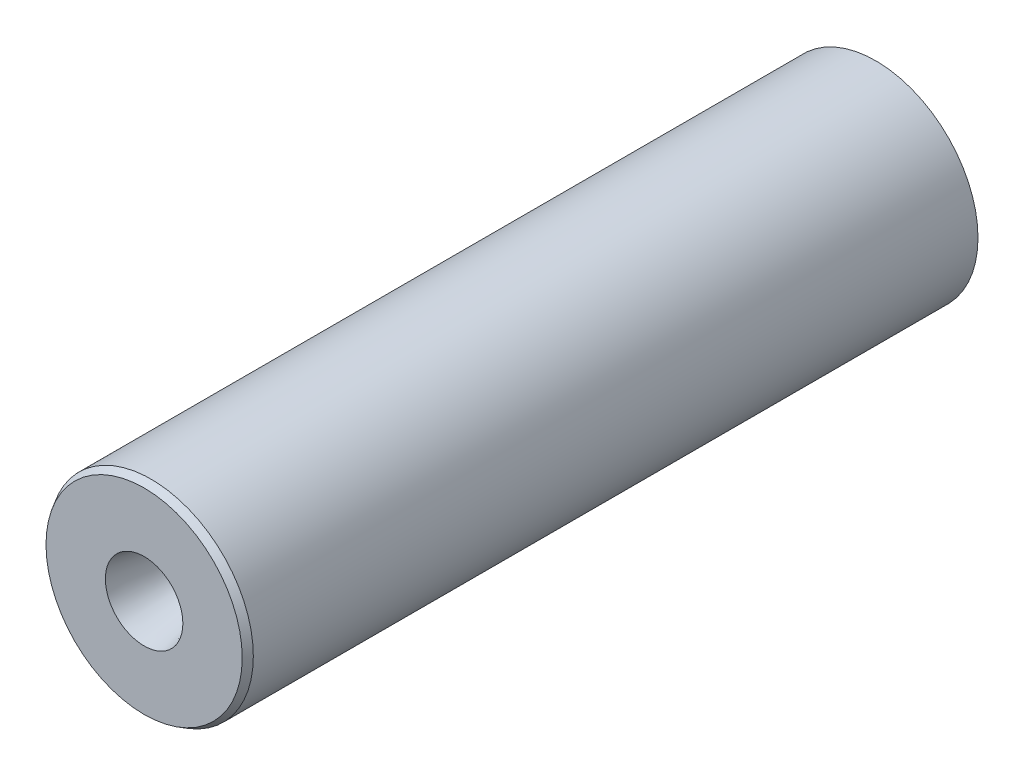
ISO-10303-21;
HEADER;
FILE_DESCRIPTION(('STEP AP214'),'2;1');
FILE_NAME('part.step','',(''),(''),'','','');
FILE_SCHEMA(('AUTOMOTIVE_DESIGN { 1 0 10303 214 1 1 1 1 }'));
ENDSEC;
DATA;
#1=APPLICATION_CONTEXT('core data for automotive mechanical design processes');
#2=APPLICATION_PROTOCOL_DEFINITION('international standard','automotive_design',2000,#1);
#3=PRODUCT_CONTEXT('',#1,'mechanical');
#4=PRODUCT('Part','Part','',(#3));
#5=PRODUCT_RELATED_PRODUCT_CATEGORY('part','',(#4));
#6=PRODUCT_DEFINITION_FORMATION('','',#4);
#7=PRODUCT_DEFINITION_CONTEXT('part definition',#1,'design');
#8=PRODUCT_DEFINITION('design','',#6,#7);
#9=PRODUCT_DEFINITION_SHAPE('','',#8);
#10=(LENGTH_UNIT() NAMED_UNIT(*) SI_UNIT(.MILLI.,.METRE.));
#11=(NAMED_UNIT(*) PLANE_ANGLE_UNIT() SI_UNIT($,.RADIAN.));
#12=(NAMED_UNIT(*) SI_UNIT($,.STERADIAN.) SOLID_ANGLE_UNIT());
#13=UNCERTAINTY_MEASURE_WITH_UNIT(LENGTH_MEASURE(1.E-05),#10,'distance_accuracy_value','');
#14=(GEOMETRIC_REPRESENTATION_CONTEXT(3) GLOBAL_UNCERTAINTY_ASSIGNED_CONTEXT((#13)) GLOBAL_UNIT_ASSIGNED_CONTEXT((#10,
#11,#12)) REPRESENTATION_CONTEXT('',''));
#15=CARTESIAN_POINT('',(0.,0.,0.));
#16=DIRECTION('',(0.,0.,1.));
#17=DIRECTION('',(1.,0.,0.));
#18=AXIS2_PLACEMENT_3D('',#15,#16,#17);
#19=CARTESIAN_POINT('',(0.,0.,51.9181610963858));
#20=DIRECTION('',(0.,0.,1.));
#21=DIRECTION('',(1.,0.,0.));
#22=AXIS2_PLACEMENT_3D('',#19,#20,#21);
#23=CYLINDRICAL_SURFACE('',#22,11.);
#24=CARTESIAN_POINT('',(0.,0.,21.7420929414587));
#25=DIRECTION('',(0.,0.,1.));
#26=DIRECTION('',(1.,0.,0.));
#27=AXIS2_PLACEMENT_3D('',#24,#25,#26);
#28=CIRCLE('',#27,11.);
#29=CARTESIAN_POINT('',(11.,0.,21.7420929414587));
#30=VERTEX_POINT('',#29);
#31=EDGE_CURVE('E56',#30,#30,#28,.T.);
#32=ORIENTED_EDGE('',*,*,#31,.T.);
#33=EDGE_LOOP('',(#32));
#34=FACE_BOUND('',#33,.T.);
#35=CARTESIAN_POINT('',(0.,0.,-36.9181610963857));
#36=DIRECTION('',(0.,0.,-1.));
#37=DIRECTION('',(0.,1.,0.));
#38=AXIS2_PLACEMENT_3D('',#35,#36,#37);
#39=CIRCLE('',#38,11.);
#40=CARTESIAN_POINT('',(0.,11.,-36.9181610963857));
#41=VERTEX_POINT('',#40);
#42=EDGE_CURVE('E60',#41,#41,#39,.F.);
#43=ORIENTED_EDGE('',*,*,#42,.F.);
#44=EDGE_LOOP('',(#43));
#45=FACE_BOUND('',#44,.T.);
#46=ADVANCED_FACE('F33',(#34,#45),#23,.F.);
#47=CARTESIAN_POINT('',(0.,0.,-51.9181610963858));
#48=DIRECTION('',(0.,0.,-1.));
#49=DIRECTION('',(-1.,0.,0.));
#50=AXIS2_PLACEMENT_3D('',#47,#48,#49);
#51=CIRCLE('',#50,11.);
#52=CARTESIAN_POINT('',(-11.,0.,-51.9181610963858));
#53=VERTEX_POINT('',#52);
#54=EDGE_CURVE('E63',#53,#53,#51,.T.);
#55=ORIENTED_EDGE('',*,*,#54,.T.);
#56=EDGE_LOOP('',(#55));
#57=FACE_BOUND('',#56,.T.);
#58=CARTESIAN_POINT('',(0.,0.,-48.9181610963857));
#59=DIRECTION('',(0.,0.,1.));
#60=DIRECTION('',(0.,-1.,0.));
#61=AXIS2_PLACEMENT_3D('',#58,#59,#60);
#62=CIRCLE('',#61,11.);
#63=CARTESIAN_POINT('',(0.,-11.,-48.9181610963857));
#64=VERTEX_POINT('',#63);
#65=EDGE_CURVE('E101',#64,#64,#62,.T.);
#66=ORIENTED_EDGE('',*,*,#65,.T.);
#67=EDGE_LOOP('',(#66));
#68=FACE_BOUND('',#67,.T.);
#69=ADVANCED_FACE('F105',(#57,#68),#23,.F.);
#70=CARTESIAN_POINT('',(0.,14.5,51.9181610963858));
#71=DIRECTION('',(0.,0.,-1.));
#72=DIRECTION('',(-1.,0.,0.));
#73=AXIS2_PLACEMENT_3D('',#70,#71,#72);
#74=PLANE('',#73);
#75=CARTESIAN_POINT('',(0.,0.,51.9181610963858));
#76=DIRECTION('',(0.,0.,-1.));
#77=DIRECTION('',(-1.,0.,0.));
#78=AXIS2_PLACEMENT_3D('',#75,#76,#77);
#79=CIRCLE('',#78,13.9226497308104);
#80=CARTESIAN_POINT('',(-13.9226497308104,0.,51.9181610963858));
#81=VERTEX_POINT('',#80);
#82=EDGE_CURVE('E40',#81,#81,#79,.F.);
#83=ORIENTED_EDGE('',*,*,#82,.T.);
#84=EDGE_LOOP('',(#83));
#85=FACE_BOUND('',#84,.T.);
#86=CARTESIAN_POINT('',(0.,0.,51.9181610963858));
#87=DIRECTION('',(0.,0.,1.));
#88=DIRECTION('',(1.,0.,0.));
#89=AXIS2_PLACEMENT_3D('',#86,#87,#88);
#90=CIRCLE('',#89,5.5);
#91=CARTESIAN_POINT('',(5.5,0.,51.9181610963858));
#92=VERTEX_POINT('',#91);
#93=EDGE_CURVE('E59',#92,#92,#90,.T.);
#94=ORIENTED_EDGE('',*,*,#93,.F.);
#95=EDGE_LOOP('',(#94));
#96=FACE_BOUND('',#95,.T.);
#97=ADVANCED_FACE('F129',(#85,#96),#74,.F.);
#98=CARTESIAN_POINT('',(0.,0.,51.9181610963858));
#99=DIRECTION('',(0.,0.,1.));
#100=DIRECTION('',(1.,0.,0.));
#101=AXIS2_PLACEMENT_3D('',#98,#99,#100);
#102=CONICAL_SURFACE('',#101,5.5,0.209439510239313);
#103=CARTESIAN_POINT('',(0.,0.,39.6816491923393));
#104=DIRECTION('',(0.,0.,-1.));
#105=DIRECTION('',(-1.,0.,0.));
#106=AXIS2_PLACEMENT_3D('',#103,#104,#105);
#107=CIRCLE('',#106,2.89904910284168);
#108=CARTESIAN_POINT('',(-2.89904910284168,0.,39.6816491923393));
#109=VERTEX_POINT('',#108);
#110=EDGE_CURVE('E44',#109,#109,#107,.T.);
#111=ORIENTED_EDGE('',*,*,#110,.T.);
#112=EDGE_LOOP('',(#111));
#113=FACE_BOUND('',#112,.T.);
#114=ORIENTED_EDGE('',*,*,#93,.T.);
#115=EDGE_LOOP('',(#114));
#116=FACE_BOUND('',#115,.T.);
#117=ADVANCED_FACE('F178',(#113,#116),#102,.F.);
#118=CARTESIAN_POINT('',(0.,0.,37.8042707679499));
#119=DIRECTION('',(0.,0.,-1.));
#120=DIRECTION('',(-1.,0.,0.));
#121=AXIS2_PLACEMENT_3D('',#118,#119,#120);
#122=CONICAL_SURFACE('',#121,2.5,0.523598775598293);
#123=CARTESIAN_POINT('',(0.,0.,24.2420929414586));
#124=DIRECTION('',(0.,0.,-1.));
#125=DIRECTION('',(-1.,0.,0.));
#126=AXIS2_PLACEMENT_3D('',#123,#124,#125);
#127=CIRCLE('',#126,10.3301270189222);
#128=CARTESIAN_POINT('',(-10.3301270189222,0.,24.2420929414586));
#129=VERTEX_POINT('',#128);
#130=EDGE_CURVE('E48',#129,#129,#127,.T.);
#131=ORIENTED_EDGE('',*,*,#130,.T.);
#132=EDGE_LOOP('',(#131));
#133=FACE_BOUND('',#132,.T.);
#134=CARTESIAN_POINT('',(0.,0.,36.1420907382506));
#135=DIRECTION('',(0.,0.,1.));
#136=DIRECTION('',(1.,0.,0.));
#137=AXIS2_PLACEMENT_3D('',#134,#135,#136);
#138=CIRCLE('',#137,3.45966008758851);
#139=CARTESIAN_POINT('',(3.45966008758851,0.,36.1420907382506));
#140=VERTEX_POINT('',#139);
#141=EDGE_CURVE('E53',#140,#140,#138,.T.);
#142=ORIENTED_EDGE('',*,*,#141,.T.);
#143=EDGE_LOOP('',(#142));
#144=FACE_BOUND('',#143,.T.);
#145=ADVANCED_FACE('F173',(#133,#144),#122,.F.);
#146=CARTESIAN_POINT('',(0.,14.5,-51.9181610963858));
#147=DIRECTION('',(0.,0.,1.));
#148=DIRECTION('',(1.,0.,0.));
#149=AXIS2_PLACEMENT_3D('',#146,#147,#148);
#150=PLANE('',#149);
#151=ORIENTED_EDGE('',*,*,#54,.F.);
#152=EDGE_LOOP('',(#151));
#153=FACE_BOUND('',#152,.T.);
#154=CARTESIAN_POINT('',(0.,0.,-51.9181610963858));
#155=DIRECTION('',(0.,0.,1.));
#156=DIRECTION('',(1.,0.,0.));
#157=AXIS2_PLACEMENT_3D('',#154,#155,#156);
#158=CIRCLE('',#157,14.5);
#159=CARTESIAN_POINT('',(14.5,0.,-51.9181610963858));
#160=VERTEX_POINT('',#159);
#161=EDGE_CURVE('E67',#160,#160,#158,.T.);
#162=ORIENTED_EDGE('',*,*,#161,.F.);
#163=EDGE_LOOP('',(#162));
#164=FACE_BOUND('',#163,.T.);
#165=ADVANCED_FACE('F171',(#153,#164),#150,.F.);
#166=CARTESIAN_POINT('',(0.,0.,51.9181610963858));
#167=DIRECTION('',(0.,0.,1.));
#168=DIRECTION('',(1.,0.,0.));
#169=AXIS2_PLACEMENT_3D('',#166,#167,#168);
#170=CYLINDRICAL_SURFACE('',#169,14.5);
#171=CARTESIAN_POINT('',(0.,0.,50.9181610963858));
#172=DIRECTION('',(0.,0.,-1.));
#173=DIRECTION('',(-1.,0.,0.));
#174=AXIS2_PLACEMENT_3D('',#171,#172,#173);
#175=CIRCLE('',#174,14.5);
#176=CARTESIAN_POINT('',(-14.5,0.,50.9181610963858));
#177=VERTEX_POINT('',#176);
#178=EDGE_CURVE('E10',#177,#177,#175,.T.);
#179=ORIENTED_EDGE('',*,*,#178,.T.);
#180=EDGE_LOOP('',(#179));
#181=FACE_BOUND('',#180,.T.);
#182=ORIENTED_EDGE('',*,*,#161,.T.);
#183=EDGE_LOOP('',(#182));
#184=FACE_BOUND('',#183,.T.);
#185=ADVANCED_FACE('F169',(#181,#184),#170,.T.);
#186=CARTESIAN_POINT('',(0.,12.,-46.9181610963857));
#187=DIRECTION('',(0.,0.,-1.));
#188=DIRECTION('',(0.,1.,0.));
#189=AXIS2_PLACEMENT_3D('',#186,#187,#188);
#190=PLANE('',#189);
#191=CARTESIAN_POINT('',(0.,0.,-46.9181610963858));
#192=DIRECTION('',(0.,0.,1.));
#193=DIRECTION('',(0.,-1.,0.));
#194=AXIS2_PLACEMENT_3D('',#191,#192,#193);
#195=CIRCLE('',#194,11.);
#196=CARTESIAN_POINT('',(0.,-11.,-46.9181610963858));
#197=VERTEX_POINT('',#196);
#198=EDGE_CURVE('E92',#197,#197,#195,.T.);
#199=ORIENTED_EDGE('',*,*,#198,.T.);
#200=EDGE_LOOP('',(#199));
#201=FACE_BOUND('',#200,.T.);
#202=CARTESIAN_POINT('',(0.,0.,-46.9181610963857));
#203=DIRECTION('',(0.,0.,1.));
#204=DIRECTION('',(0.,-1.,0.));
#205=AXIS2_PLACEMENT_3D('',#202,#203,#204);
#206=CIRCLE('',#205,12.);
#207=CARTESIAN_POINT('',(0.,-12.,-46.9181610963857));
#208=VERTEX_POINT('',#207);
#209=EDGE_CURVE('E95',#208,#208,#206,.T.);
#210=ORIENTED_EDGE('',*,*,#209,.F.);
#211=EDGE_LOOP('',(#210));
#212=FACE_BOUND('',#211,.T.);
#213=ADVANCED_FACE('F121',(#201,#212),#190,.T.);
#214=CARTESIAN_POINT('',(0.,0.,0.));
#215=DIRECTION('',(0.,0.,1.));
#216=DIRECTION('',(0.,-1.,0.));
#217=AXIS2_PLACEMENT_3D('',#214,#215,#216);
#218=CYLINDRICAL_SURFACE('',#217,12.);
#219=ORIENTED_EDGE('',*,*,#209,.T.);
#220=EDGE_LOOP('',(#219));
#221=FACE_BOUND('',#220,.T.);
#222=CARTESIAN_POINT('',(0.,0.,-48.9181610963857));
#223=DIRECTION('',(0.,0.,1.));
#224=DIRECTION('',(0.,-1.,0.));
#225=AXIS2_PLACEMENT_3D('',#222,#223,#224);
#226=CIRCLE('',#225,12.);
#227=CARTESIAN_POINT('',(0.,-12.,-48.9181610963857));
#228=VERTEX_POINT('',#227);
#229=EDGE_CURVE('E98',#228,#228,#226,.T.);
#230=ORIENTED_EDGE('',*,*,#229,.F.);
#231=EDGE_LOOP('',(#230));
#232=FACE_BOUND('',#231,.T.);
#233=ADVANCED_FACE('F110',(#221,#232),#218,.F.);
#234=CARTESIAN_POINT('',(0.,11.,-48.9181610963857));
#235=DIRECTION('',(0.,0.,1.));
#236=DIRECTION('',(0.,-1.,0.));
#237=AXIS2_PLACEMENT_3D('',#234,#235,#236);
#238=PLANE('',#237);
#239=ORIENTED_EDGE('',*,*,#229,.T.);
#240=EDGE_LOOP('',(#239));
#241=FACE_BOUND('',#240,.T.);
#242=ORIENTED_EDGE('',*,*,#65,.F.);
#243=EDGE_LOOP('',(#242));
#244=FACE_BOUND('',#243,.T.);
#245=ADVANCED_FACE('F107',(#241,#244),#238,.T.);
#246=ORIENTED_EDGE('',*,*,#198,.F.);
#247=EDGE_LOOP('',(#246));
#248=FACE_BOUND('',#247,.T.);
#249=CARTESIAN_POINT('',(0.,0.,-43.9181610963858));
#250=DIRECTION('',(0.,0.,1.));
#251=DIRECTION('',(0.,-1.,0.));
#252=AXIS2_PLACEMENT_3D('',#249,#250,#251);
#253=CIRCLE('',#252,11.);
#254=CARTESIAN_POINT('',(0.,-11.,-43.9181610963858));
#255=VERTEX_POINT('',#254);
#256=EDGE_CURVE('E89',#255,#255,#253,.T.);
#257=ORIENTED_EDGE('',*,*,#256,.T.);
#258=EDGE_LOOP('',(#257));
#259=FACE_BOUND('',#258,.T.);
#260=ADVANCED_FACE('F109',(#248,#259),#23,.F.);
#261=CARTESIAN_POINT('',(0.,12.,-41.9181610963858));
#262=DIRECTION('',(0.,0.,-1.));
#263=DIRECTION('',(0.,1.,0.));
#264=AXIS2_PLACEMENT_3D('',#261,#262,#263);
#265=PLANE('',#264);
#266=CARTESIAN_POINT('',(0.,0.,-41.9181610963858));
#267=DIRECTION('',(0.,0.,1.));
#268=DIRECTION('',(0.,-1.,0.));
#269=AXIS2_PLACEMENT_3D('',#266,#267,#268);
#270=CIRCLE('',#269,11.);
#271=CARTESIAN_POINT('',(0.,-11.,-41.9181610963858));
#272=VERTEX_POINT('',#271);
#273=EDGE_CURVE('E80',#272,#272,#270,.T.);
#274=ORIENTED_EDGE('',*,*,#273,.T.);
#275=EDGE_LOOP('',(#274));
#276=FACE_BOUND('',#275,.T.);
#277=CARTESIAN_POINT('',(0.,0.,-41.9181610963858));
#278=DIRECTION('',(0.,0.,1.));
#279=DIRECTION('',(0.,-1.,0.));
#280=AXIS2_PLACEMENT_3D('',#277,#278,#279);
#281=CIRCLE('',#280,12.);
#282=CARTESIAN_POINT('',(0.,-12.,-41.9181610963858));
#283=VERTEX_POINT('',#282);
#284=EDGE_CURVE('E83',#283,#283,#281,.T.);
#285=ORIENTED_EDGE('',*,*,#284,.F.);
#286=EDGE_LOOP('',(#285));
#287=FACE_BOUND('',#286,.T.);
#288=ADVANCED_FACE('F117',(#276,#287),#265,.T.);
#289=CARTESIAN_POINT('',(0.,0.,0.));
#290=DIRECTION('',(0.,0.,1.));
#291=DIRECTION('',(0.,-1.,0.));
#292=AXIS2_PLACEMENT_3D('',#289,#290,#291);
#293=CYLINDRICAL_SURFACE('',#292,12.);
#294=ORIENTED_EDGE('',*,*,#284,.T.);
#295=EDGE_LOOP('',(#294));
#296=FACE_BOUND('',#295,.T.);
#297=CARTESIAN_POINT('',(0.,0.,-43.9181610963858));
#298=DIRECTION('',(0.,0.,1.));
#299=DIRECTION('',(0.,-1.,0.));
#300=AXIS2_PLACEMENT_3D('',#297,#298,#299);
#301=CIRCLE('',#300,12.);
#302=CARTESIAN_POINT('',(0.,-12.,-43.9181610963858));
#303=VERTEX_POINT('',#302);
#304=EDGE_CURVE('E86',#303,#303,#301,.T.);
#305=ORIENTED_EDGE('',*,*,#304,.F.);
#306=EDGE_LOOP('',(#305));
#307=FACE_BOUND('',#306,.T.);
#308=ADVANCED_FACE('F145',(#296,#307),#293,.F.);
#309=CARTESIAN_POINT('',(0.,11.,-43.9181610963858));
#310=DIRECTION('',(0.,0.,1.));
#311=DIRECTION('',(0.,-1.,0.));
#312=AXIS2_PLACEMENT_3D('',#309,#310,#311);
#313=PLANE('',#312);
#314=ORIENTED_EDGE('',*,*,#304,.T.);
#315=EDGE_LOOP('',(#314));
#316=FACE_BOUND('',#315,.T.);
#317=ORIENTED_EDGE('',*,*,#256,.F.);
#318=EDGE_LOOP('',(#317));
#319=FACE_BOUND('',#318,.T.);
#320=ADVANCED_FACE('F136',(#316,#319),#313,.T.);
#321=ORIENTED_EDGE('',*,*,#273,.F.);
#322=EDGE_LOOP('',(#321));
#323=FACE_BOUND('',#322,.T.);
#324=CARTESIAN_POINT('',(0.,0.,-38.9181610963857));
#325=DIRECTION('',(0.,0.,1.));
#326=DIRECTION('',(0.,-1.,0.));
#327=AXIS2_PLACEMENT_3D('',#324,#325,#326);
#328=CIRCLE('',#327,11.);
#329=CARTESIAN_POINT('',(0.,-11.,-38.9181610963857));
#330=VERTEX_POINT('',#329);
#331=EDGE_CURVE('E77',#330,#330,#328,.T.);
#332=ORIENTED_EDGE('',*,*,#331,.T.);
#333=EDGE_LOOP('',(#332));
#334=FACE_BOUND('',#333,.T.);
#335=ADVANCED_FACE('F120',(#323,#334),#23,.F.);
#336=CARTESIAN_POINT('',(0.,12.,-36.9181610963857));
#337=DIRECTION('',(0.,0.,-1.));
#338=DIRECTION('',(0.,1.,0.));
#339=AXIS2_PLACEMENT_3D('',#336,#337,#338);
#340=PLANE('',#339);
#341=CARTESIAN_POINT('',(0.,0.,-36.9181610963857));
#342=DIRECTION('',(0.,0.,1.));
#343=DIRECTION('',(0.,-1.,0.));
#344=AXIS2_PLACEMENT_3D('',#341,#342,#343);
#345=CIRCLE('',#344,12.);
#346=CARTESIAN_POINT('',(0.,-12.,-36.9181610963857));
#347=VERTEX_POINT('',#346);
#348=EDGE_CURVE('E64',#347,#347,#345,.T.);
#349=ORIENTED_EDGE('',*,*,#348,.F.);
#350=EDGE_LOOP('',(#349));
#351=FACE_BOUND('',#350,.T.);
#352=ORIENTED_EDGE('',*,*,#42,.T.);
#353=EDGE_LOOP('',(#352));
#354=FACE_BOUND('',#353,.T.);
#355=ADVANCED_FACE('F135',(#351,#354),#340,.T.);
#356=CARTESIAN_POINT('',(0.,0.,0.));
#357=DIRECTION('',(0.,0.,1.));
#358=DIRECTION('',(0.,-1.,0.));
#359=AXIS2_PLACEMENT_3D('',#356,#357,#358);
#360=CYLINDRICAL_SURFACE('',#359,12.);
#361=ORIENTED_EDGE('',*,*,#348,.T.);
#362=EDGE_LOOP('',(#361));
#363=FACE_BOUND('',#362,.T.);
#364=CARTESIAN_POINT('',(0.,0.,-38.9181610963857));
#365=DIRECTION('',(0.,0.,1.));
#366=DIRECTION('',(0.,-1.,0.));
#367=AXIS2_PLACEMENT_3D('',#364,#365,#366);
#368=CIRCLE('',#367,12.);
#369=CARTESIAN_POINT('',(0.,-12.,-38.9181610963857));
#370=VERTEX_POINT('',#369);
#371=EDGE_CURVE('E74',#370,#370,#368,.T.);
#372=ORIENTED_EDGE('',*,*,#371,.F.);
#373=EDGE_LOOP('',(#372));
#374=FACE_BOUND('',#373,.T.);
#375=ADVANCED_FACE('F142',(#363,#374),#360,.F.);
#376=CARTESIAN_POINT('',(0.,11.,-38.9181610963857));
#377=DIRECTION('',(0.,0.,1.));
#378=DIRECTION('',(0.,-1.,0.));
#379=AXIS2_PLACEMENT_3D('',#376,#377,#378);
#380=PLANE('',#379);
#381=ORIENTED_EDGE('',*,*,#371,.T.);
#382=EDGE_LOOP('',(#381));
#383=FACE_BOUND('',#382,.T.);
#384=ORIENTED_EDGE('',*,*,#331,.F.);
#385=EDGE_LOOP('',(#384));
#386=FACE_BOUND('',#385,.T.);
#387=ADVANCED_FACE('F152',(#383,#386),#380,.T.);
#388=CARTESIAN_POINT('',(0.,0.,21.7420929414587));
#389=DIRECTION('',(0.,0.,1.));
#390=DIRECTION('',(1.,0.,0.));
#391=AXIS2_PLACEMENT_3D('',#388,#389,#390);
#392=TOROIDAL_SURFACE('',#391,6.,5.);
#393=ORIENTED_EDGE('',*,*,#130,.F.);
#394=EDGE_LOOP('',(#393));
#395=FACE_BOUND('',#394,.T.);
#396=ORIENTED_EDGE('',*,*,#31,.F.);
#397=EDGE_LOOP('',(#396));
#398=FACE_BOUND('',#397,.T.);
#399=ADVANCED_FACE('F154',(#395,#398),#392,.F.);
#400=CARTESIAN_POINT('',(0.,0.,38.6420907382506));
#401=DIRECTION('',(0.,0.,-1.));
#402=DIRECTION('',(-1.,0.,0.));
#403=AXIS2_PLACEMENT_3D('',#400,#401,#402);
#404=TOROIDAL_SURFACE('',#403,7.78978710651072,5.);
#405=ORIENTED_EDGE('',*,*,#110,.F.);
#406=EDGE_LOOP('',(#405));
#407=FACE_BOUND('',#406,.T.);
#408=ORIENTED_EDGE('',*,*,#141,.F.);
#409=EDGE_LOOP('',(#408));
#410=FACE_BOUND('',#409,.T.);
#411=ADVANCED_FACE('F161',(#407,#410),#404,.T.);
#412=CARTESIAN_POINT('',(0.,0.,51.9181610963858));
#413=DIRECTION('',(0.,0.,-1.));
#414=DIRECTION('',(-1.,0.,0.));
#415=AXIS2_PLACEMENT_3D('',#412,#413,#414);
#416=CONICAL_SURFACE('',#415,13.9226497308104,0.523598775598293);
#417=ORIENTED_EDGE('',*,*,#178,.F.);
#418=EDGE_LOOP('',(#417));
#419=FACE_BOUND('',#418,.T.);
#420=ORIENTED_EDGE('',*,*,#82,.F.);
#421=EDGE_LOOP('',(#420));
#422=FACE_BOUND('',#421,.T.);
#423=ADVANCED_FACE('F35',(#419,#422),#416,.T.);
#424=CLOSED_SHELL('',(#46,#69,#97,#117,#145,#165,#185,#213,#233,#245,#260,#288,#308,#320,#335,
#355,#375,#387,#399,#411,#423));
#425=MANIFOLD_SOLID_BREP('B2',#424);
#426=ADVANCED_BREP_SHAPE_REPRESENTATION('',(#18,#425),#14);
#427=SHAPE_DEFINITION_REPRESENTATION(#9,#426);
ENDSEC;
END-ISO-10303-21;
